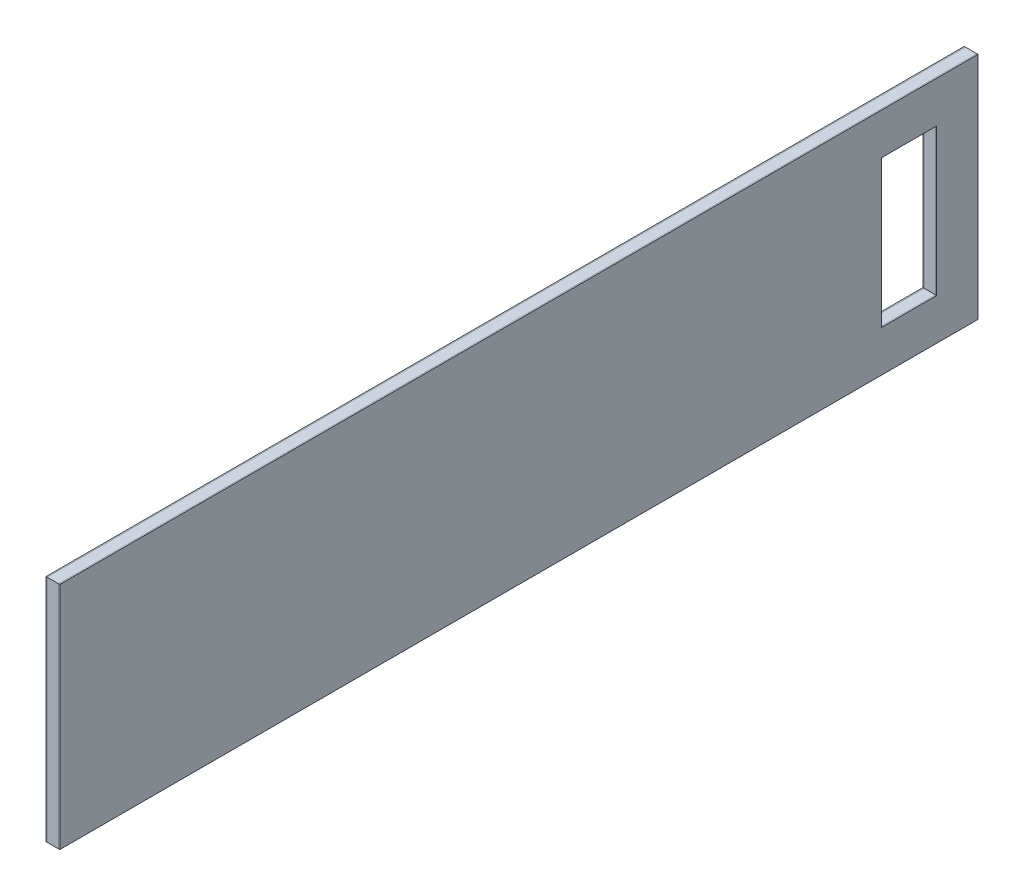
ISO-10303-21;
HEADER;
FILE_DESCRIPTION(('STEP AP214'),'2;1');
FILE_NAME('part.step','',(''),(''),'','','');
FILE_SCHEMA(('AUTOMOTIVE_DESIGN { 1 0 10303 214 1 1 1 1 }'));
ENDSEC;
DATA;
#1=APPLICATION_CONTEXT('core data for automotive mechanical design processes');
#2=APPLICATION_PROTOCOL_DEFINITION('international standard','automotive_design',2000,#1);
#3=PRODUCT_CONTEXT('',#1,'mechanical');
#4=PRODUCT('Part','Part','',(#3));
#5=PRODUCT_RELATED_PRODUCT_CATEGORY('part','',(#4));
#6=PRODUCT_DEFINITION_FORMATION('','',#4);
#7=PRODUCT_DEFINITION_CONTEXT('part definition',#1,'design');
#8=PRODUCT_DEFINITION('design','',#6,#7);
#9=PRODUCT_DEFINITION_SHAPE('','',#8);
#10=(LENGTH_UNIT() NAMED_UNIT(*) SI_UNIT(.MILLI.,.METRE.));
#11=(NAMED_UNIT(*) PLANE_ANGLE_UNIT() SI_UNIT($,.RADIAN.));
#12=(NAMED_UNIT(*) SI_UNIT($,.STERADIAN.) SOLID_ANGLE_UNIT());
#13=UNCERTAINTY_MEASURE_WITH_UNIT(LENGTH_MEASURE(1.E-05),#10,'distance_accuracy_value','');
#14=(GEOMETRIC_REPRESENTATION_CONTEXT(3) GLOBAL_UNCERTAINTY_ASSIGNED_CONTEXT((#13)) GLOBAL_UNIT_ASSIGNED_CONTEXT((#10,
#11,#12)) REPRESENTATION_CONTEXT('',''));
#15=CARTESIAN_POINT('',(0.,0.,0.));
#16=DIRECTION('',(0.,0.,1.));
#17=DIRECTION('',(1.,0.,0.));
#18=AXIS2_PLACEMENT_3D('',#15,#16,#17);
#19=CARTESIAN_POINT('',(-2.75,0.,-79.));
#20=DIRECTION('',(0.,0.,1.));
#21=DIRECTION('',(1.,0.,0.));
#22=AXIS2_PLACEMENT_3D('',#19,#20,#21);
#23=PLANE('',#22);
#24=DIRECTION('',(0.,-1.,0.));
#25=VECTOR('',#24,1.);
#26=CARTESIAN_POINT('',(-2.5,0.,-79.));
#27=LINE('',#26,#25);
#28=CARTESIAN_POINT('',(-2.5,16.,-79.));
#29=VERTEX_POINT('',#28);
#30=CARTESIAN_POINT('',(-2.5,-16.,-79.));
#31=VERTEX_POINT('',#30);
#32=EDGE_CURVE('E165',#29,#31,#27,.T.);
#33=ORIENTED_EDGE('',*,*,#32,.T.);
#34=DIRECTION('',(1.,0.,0.));
#35=VECTOR('',#34,1.);
#36=CARTESIAN_POINT('',(-2.75,-16.,-79.));
#37=LINE('',#36,#35);
#38=CARTESIAN_POINT('',(-2.75,-16.,-79.));
#39=VERTEX_POINT('',#38);
#40=EDGE_CURVE('E12',#39,#31,#37,.T.);
#41=ORIENTED_EDGE('',*,*,#40,.F.);
#42=DIRECTION('',(0.,-1.,0.));
#43=VECTOR('',#42,1.);
#44=CARTESIAN_POINT('',(-2.75,0.,-79.));
#45=LINE('',#44,#43);
#46=CARTESIAN_POINT('',(-2.75,16.,-79.));
#47=VERTEX_POINT('',#46);
#48=EDGE_CURVE('E142',#47,#39,#45,.T.);
#49=ORIENTED_EDGE('',*,*,#48,.F.);
#50=DIRECTION('',(1.,0.,0.));
#51=VECTOR('',#50,1.);
#52=CARTESIAN_POINT('',(-2.75,16.,-79.));
#53=LINE('',#52,#51);
#54=EDGE_CURVE('E172',#47,#29,#53,.T.);
#55=ORIENTED_EDGE('',*,*,#54,.T.);
#56=EDGE_LOOP('',(#33,#41,#49,#55));
#57=FACE_BOUND('',#56,.T.);
#58=ADVANCED_FACE('F60',(#57),#23,.F.);
#59=CARTESIAN_POINT('',(-2.75,-16.,0.));
#60=DIRECTION('',(0.,-1.,0.));
#61=DIRECTION('',(0.,0.,-1.));
#62=AXIS2_PLACEMENT_3D('',#59,#60,#61);
#63=PLANE('',#62);
#64=DIRECTION('',(0.,0.,-1.));
#65=VECTOR('',#64,1.);
#66=CARTESIAN_POINT('',(-2.5,-16.,0.));
#67=LINE('',#66,#65);
#68=CARTESIAN_POINT('',(-2.5,-16.,-91.));
#69=VERTEX_POINT('',#68);
#70=EDGE_CURVE('E147',#31,#69,#67,.T.);
#71=ORIENTED_EDGE('',*,*,#70,.T.);
#72=DIRECTION('',(1.,0.,0.));
#73=VECTOR('',#72,1.);
#74=CARTESIAN_POINT('',(-2.75,-16.,-91.));
#75=LINE('',#74,#73);
#76=CARTESIAN_POINT('',(-2.75,-16.,-91.));
#77=VERTEX_POINT('',#76);
#78=EDGE_CURVE('E70',#77,#69,#75,.T.);
#79=ORIENTED_EDGE('',*,*,#78,.F.);
#80=DIRECTION('',(0.,0.,-1.));
#81=VECTOR('',#80,1.);
#82=CARTESIAN_POINT('',(-2.75,-16.,0.));
#83=LINE('',#82,#81);
#84=EDGE_CURVE('E136',#39,#77,#83,.T.);
#85=ORIENTED_EDGE('',*,*,#84,.F.);
#86=ORIENTED_EDGE('',*,*,#40,.T.);
#87=EDGE_LOOP('',(#71,#79,#85,#86));
#88=FACE_BOUND('',#87,.T.);
#89=ADVANCED_FACE('F146',(#88),#63,.F.);
#90=CARTESIAN_POINT('',(-2.75,0.,-91.));
#91=DIRECTION('',(0.,0.,-1.));
#92=DIRECTION('',(-1.,0.,0.));
#93=AXIS2_PLACEMENT_3D('',#90,#91,#92);
#94=PLANE('',#93);
#95=DIRECTION('',(0.,1.,0.));
#96=VECTOR('',#95,1.);
#97=CARTESIAN_POINT('',(-2.5,0.,-91.));
#98=LINE('',#97,#96);
#99=CARTESIAN_POINT('',(-2.5,16.,-91.));
#100=VERTEX_POINT('',#99);
#101=EDGE_CURVE('E108',#69,#100,#98,.T.);
#102=ORIENTED_EDGE('',*,*,#101,.T.);
#103=DIRECTION('',(1.,0.,0.));
#104=VECTOR('',#103,1.);
#105=CARTESIAN_POINT('',(-2.75,16.,-91.));
#106=LINE('',#105,#104);
#107=CARTESIAN_POINT('',(-2.75,16.,-91.));
#108=VERTEX_POINT('',#107);
#109=EDGE_CURVE('E148',#108,#100,#106,.T.);
#110=ORIENTED_EDGE('',*,*,#109,.F.);
#111=DIRECTION('',(0.,1.,0.));
#112=VECTOR('',#111,1.);
#113=CARTESIAN_POINT('',(-2.75,0.,-91.));
#114=LINE('',#113,#112);
#115=EDGE_CURVE('E140',#77,#108,#114,.T.);
#116=ORIENTED_EDGE('',*,*,#115,.F.);
#117=ORIENTED_EDGE('',*,*,#78,.T.);
#118=EDGE_LOOP('',(#102,#110,#116,#117));
#119=FACE_BOUND('',#118,.T.);
#120=ADVANCED_FACE('F150',(#119),#94,.F.);
#121=CARTESIAN_POINT('',(-2.75,0.,100.));
#122=DIRECTION('',(0.,0.,-1.));
#123=DIRECTION('',(0.,1.,0.));
#124=AXIS2_PLACEMENT_3D('',#121,#122,#123);
#125=PLANE('',#124);
#126=DIRECTION('',(0.,1.,0.));
#127=VECTOR('',#126,1.);
#128=CARTESIAN_POINT('',(-2.5,0.,100.));
#129=LINE('',#128,#127);
#130=CARTESIAN_POINT('',(-2.5,-25.,100.));
#131=VERTEX_POINT('',#130);
#132=CARTESIAN_POINT('',(-2.5,25.,100.));
#133=VERTEX_POINT('',#132);
#134=EDGE_CURVE('E156',#131,#133,#129,.T.);
#135=ORIENTED_EDGE('',*,*,#134,.T.);
#136=DIRECTION('',(1.,0.,0.));
#137=VECTOR('',#136,1.);
#138=CARTESIAN_POINT('',(-2.75,25.,100.));
#139=LINE('',#138,#137);
#140=CARTESIAN_POINT('',(-2.75,25.,100.));
#141=VERTEX_POINT('',#140);
#142=EDGE_CURVE('E64',#141,#133,#139,.T.);
#143=ORIENTED_EDGE('',*,*,#142,.F.);
#144=DIRECTION('',(0.,1.,0.));
#145=VECTOR('',#144,1.);
#146=CARTESIAN_POINT('',(-2.75,0.,100.));
#147=LINE('',#146,#145);
#148=CARTESIAN_POINT('',(-2.75,-25.,100.));
#149=VERTEX_POINT('',#148);
#150=EDGE_CURVE('E171',#149,#141,#147,.T.);
#151=ORIENTED_EDGE('',*,*,#150,.F.);
#152=DIRECTION('',(1.,0.,0.));
#153=VECTOR('',#152,1.);
#154=CARTESIAN_POINT('',(-2.75,-25.,100.));
#155=LINE('',#154,#153);
#156=EDGE_CURVE('E152',#149,#131,#155,.T.);
#157=ORIENTED_EDGE('',*,*,#156,.T.);
#158=EDGE_LOOP('',(#135,#143,#151,#157));
#159=FACE_BOUND('',#158,.T.);
#160=ADVANCED_FACE('F62',(#159),#125,.F.);
#161=CARTESIAN_POINT('',(-2.75,25.,0.));
#162=DIRECTION('',(0.,-1.,0.));
#163=DIRECTION('',(0.,0.,-1.));
#164=AXIS2_PLACEMENT_3D('',#161,#162,#163);
#165=PLANE('',#164);
#166=DIRECTION('',(0.,0.,-1.));
#167=VECTOR('',#166,1.);
#168=CARTESIAN_POINT('',(-2.5,25.,0.));
#169=LINE('',#168,#167);
#170=CARTESIAN_POINT('',(-2.5,25.,-100.));
#171=VERTEX_POINT('',#170);
#172=EDGE_CURVE('E159',#133,#171,#169,.T.);
#173=ORIENTED_EDGE('',*,*,#172,.T.);
#174=DIRECTION('',(1.,0.,0.));
#175=VECTOR('',#174,1.);
#176=CARTESIAN_POINT('',(-2.75,25.,-100.));
#177=LINE('',#176,#175);
#178=CARTESIAN_POINT('',(-2.75,25.,-100.));
#179=VERTEX_POINT('',#178);
#180=EDGE_CURVE('E179',#179,#171,#177,.T.);
#181=ORIENTED_EDGE('',*,*,#180,.F.);
#182=DIRECTION('',(0.,0.,-1.));
#183=VECTOR('',#182,1.);
#184=CARTESIAN_POINT('',(-2.75,25.,0.));
#185=LINE('',#184,#183);
#186=EDGE_CURVE('E123',#141,#179,#185,.T.);
#187=ORIENTED_EDGE('',*,*,#186,.F.);
#188=ORIENTED_EDGE('',*,*,#142,.T.);
#189=EDGE_LOOP('',(#173,#181,#187,#188));
#190=FACE_BOUND('',#189,.T.);
#191=ADVANCED_FACE('F185',(#190),#165,.F.);
#192=CARTESIAN_POINT('',(-2.75,0.,-100.));
#193=DIRECTION('',(0.,0.,1.));
#194=DIRECTION('',(1.,0.,0.));
#195=AXIS2_PLACEMENT_3D('',#192,#193,#194);
#196=PLANE('',#195);
#197=DIRECTION('',(0.,-1.,0.));
#198=VECTOR('',#197,1.);
#199=CARTESIAN_POINT('',(-2.5,0.,-100.));
#200=LINE('',#199,#198);
#201=CARTESIAN_POINT('',(-2.5,-25.,-99.9999999999999));
#202=VERTEX_POINT('',#201);
#203=EDGE_CURVE('E161',#171,#202,#200,.T.);
#204=ORIENTED_EDGE('',*,*,#203,.T.);
#205=DIRECTION('',(1.,0.,0.));
#206=VECTOR('',#205,1.);
#207=CARTESIAN_POINT('',(-2.75,-25.,-99.9999999999999));
#208=LINE('',#207,#206);
#209=CARTESIAN_POINT('',(-2.75,-25.,-99.9999999999999));
#210=VERTEX_POINT('',#209);
#211=EDGE_CURVE('E177',#210,#202,#208,.T.);
#212=ORIENTED_EDGE('',*,*,#211,.F.);
#213=DIRECTION('',(0.,-1.,0.));
#214=VECTOR('',#213,1.);
#215=CARTESIAN_POINT('',(-2.75,0.,-100.));
#216=LINE('',#215,#214);
#217=EDGE_CURVE('E201',#179,#210,#216,.T.);
#218=ORIENTED_EDGE('',*,*,#217,.F.);
#219=ORIENTED_EDGE('',*,*,#180,.T.);
#220=EDGE_LOOP('',(#204,#212,#218,#219));
#221=FACE_BOUND('',#220,.T.);
#222=ADVANCED_FACE('F195',(#221),#196,.F.);
#223=CARTESIAN_POINT('',(-2.75,-25.,0.));
#224=DIRECTION('',(0.,1.,0.));
#225=DIRECTION('',(0.,0.,1.));
#226=AXIS2_PLACEMENT_3D('',#223,#224,#225);
#227=PLANE('',#226);
#228=DIRECTION('',(0.,0.,1.));
#229=VECTOR('',#228,1.);
#230=CARTESIAN_POINT('',(-2.5,-25.,0.));
#231=LINE('',#230,#229);
#232=EDGE_CURVE('E163',#202,#131,#231,.T.);
#233=ORIENTED_EDGE('',*,*,#232,.T.);
#234=ORIENTED_EDGE('',*,*,#156,.F.);
#235=DIRECTION('',(0.,0.,1.));
#236=VECTOR('',#235,1.);
#237=CARTESIAN_POINT('',(-2.75,-25.,0.));
#238=LINE('',#237,#236);
#239=EDGE_CURVE('E199',#210,#149,#238,.T.);
#240=ORIENTED_EDGE('',*,*,#239,.F.);
#241=ORIENTED_EDGE('',*,*,#211,.T.);
#242=EDGE_LOOP('',(#233,#234,#240,#241));
#243=FACE_BOUND('',#242,.T.);
#244=ADVANCED_FACE('F198',(#243),#227,.F.);
#245=CARTESIAN_POINT('',(-2.75,16.,0.));
#246=DIRECTION('',(0.,1.,0.));
#247=DIRECTION('',(0.,0.,1.));
#248=AXIS2_PLACEMENT_3D('',#245,#246,#247);
#249=PLANE('',#248);
#250=DIRECTION('',(0.,0.,1.));
#251=VECTOR('',#250,1.);
#252=CARTESIAN_POINT('',(-2.5,16.,0.));
#253=LINE('',#252,#251);
#254=EDGE_CURVE('E114',#100,#29,#253,.T.);
#255=ORIENTED_EDGE('',*,*,#254,.T.);
#256=ORIENTED_EDGE('',*,*,#54,.F.);
#257=DIRECTION('',(0.,0.,1.));
#258=VECTOR('',#257,1.);
#259=CARTESIAN_POINT('',(-2.75,16.,0.));
#260=LINE('',#259,#258);
#261=EDGE_CURVE('E79',#108,#47,#260,.T.);
#262=ORIENTED_EDGE('',*,*,#261,.F.);
#263=ORIENTED_EDGE('',*,*,#109,.T.);
#264=EDGE_LOOP('',(#255,#256,#262,#263));
#265=FACE_BOUND('',#264,.T.);
#266=ADVANCED_FACE('F207',(#265),#249,.F.);
#267=CARTESIAN_POINT('',(-2.75,0.,0.));
#268=DIRECTION('',(-1.,0.,0.));
#269=DIRECTION('',(0.,0.,1.));
#270=AXIS2_PLACEMENT_3D('',#267,#268,#269);
#271=PLANE('',#270);
#272=ORIENTED_EDGE('',*,*,#150,.T.);
#273=ORIENTED_EDGE('',*,*,#186,.T.);
#274=ORIENTED_EDGE('',*,*,#217,.T.);
#275=ORIENTED_EDGE('',*,*,#239,.T.);
#276=EDGE_LOOP('',(#272,#273,#274,#275));
#277=FACE_BOUND('',#276,.T.);
#278=ORIENTED_EDGE('',*,*,#48,.T.);
#279=ORIENTED_EDGE('',*,*,#84,.T.);
#280=ORIENTED_EDGE('',*,*,#115,.T.);
#281=ORIENTED_EDGE('',*,*,#261,.T.);
#282=EDGE_LOOP('',(#278,#279,#280,#281));
#283=FACE_BOUND('',#282,.T.);
#284=ADVANCED_FACE('F138',(#277,#283),#271,.T.);
#285=CARTESIAN_POINT('',(-2.5,0.,0.));
#286=DIRECTION('',(-1.,0.,0.));
#287=DIRECTION('',(0.,0.,1.));
#288=AXIS2_PLACEMENT_3D('',#285,#286,#287);
#289=PLANE('',#288);
#290=ORIENTED_EDGE('',*,*,#134,.F.);
#291=ORIENTED_EDGE('',*,*,#232,.F.);
#292=ORIENTED_EDGE('',*,*,#203,.F.);
#293=ORIENTED_EDGE('',*,*,#172,.F.);
#294=EDGE_LOOP('',(#290,#291,#292,#293));
#295=FACE_BOUND('',#294,.T.);
#296=ORIENTED_EDGE('',*,*,#32,.F.);
#297=ORIENTED_EDGE('',*,*,#254,.F.);
#298=ORIENTED_EDGE('',*,*,#101,.F.);
#299=ORIENTED_EDGE('',*,*,#70,.F.);
#300=EDGE_LOOP('',(#296,#297,#298,#299));
#301=FACE_BOUND('',#300,.T.);
#302=ADVANCED_FACE('F192',(#295,#301),#289,.F.);
#303=CLOSED_SHELL('',(#58,#89,#120,#160,#191,#222,#244,#266,#284,#302));
#304=MANIFOLD_SOLID_BREP('B2',#303);
#305=CARTESIAN_POINT('',(-2.5,25.,0.));
#306=DIRECTION('',(0.,-1.,0.));
#307=DIRECTION('',(0.,0.,-1.));
#308=AXIS2_PLACEMENT_3D('',#305,#306,#307);
#309=PLANE('',#308);
#310=DIRECTION('',(0.,0.,-1.));
#311=VECTOR('',#310,1.);
#312=CARTESIAN_POINT('',(0.,25.,0.));
#313=LINE('',#312,#311);
#314=CARTESIAN_POINT('',(0.,25.,100.));
#315=VERTEX_POINT('',#314);
#316=CARTESIAN_POINT('',(0.,25.,-99.9999999999999));
#317=VERTEX_POINT('',#316);
#318=EDGE_CURVE('E425',#315,#317,#313,.T.);
#319=ORIENTED_EDGE('',*,*,#318,.T.);
#320=DIRECTION('',(1.,0.,0.));
#321=VECTOR('',#320,1.);
#322=CARTESIAN_POINT('',(-2.5,25.,-99.9999999999999));
#323=LINE('',#322,#321);
#324=CARTESIAN_POINT('',(-2.5,25.,-99.9999999999999));
#325=VERTEX_POINT('',#324);
#326=EDGE_CURVE('E58',#325,#317,#323,.T.);
#327=ORIENTED_EDGE('',*,*,#326,.F.);
#328=DIRECTION('',(0.,0.,-1.));
#329=VECTOR('',#328,1.);
#330=CARTESIAN_POINT('',(-2.5,25.,0.));
#331=LINE('',#330,#329);
#332=CARTESIAN_POINT('',(-2.5,25.,100.));
#333=VERTEX_POINT('',#332);
#334=EDGE_CURVE('E394',#333,#325,#331,.T.);
#335=ORIENTED_EDGE('',*,*,#334,.F.);
#336=DIRECTION('',(1.,0.,0.));
#337=VECTOR('',#336,1.);
#338=CARTESIAN_POINT('',(-2.5,25.,100.));
#339=LINE('',#338,#337);
#340=EDGE_CURVE('E436',#333,#315,#339,.T.);
#341=ORIENTED_EDGE('',*,*,#340,.T.);
#342=EDGE_LOOP('',(#319,#327,#335,#341));
#343=FACE_BOUND('',#342,.T.);
#344=ADVANCED_FACE('F311',(#343),#309,.F.);
#345=CARTESIAN_POINT('',(-2.5,0.,-100.));
#346=DIRECTION('',(0.,0.,1.));
#347=DIRECTION('',(1.,0.,0.));
#348=AXIS2_PLACEMENT_3D('',#345,#346,#347);
#349=PLANE('',#348);
#350=DIRECTION('',(0.,-1.,0.));
#351=VECTOR('',#350,1.);
#352=CARTESIAN_POINT('',(0.,0.,-100.));
#353=LINE('',#352,#351);
#354=CARTESIAN_POINT('',(0.,-25.,-99.9999999999999));
#355=VERTEX_POINT('',#354);
#356=EDGE_CURVE('E400',#317,#355,#353,.T.);
#357=ORIENTED_EDGE('',*,*,#356,.T.);
#358=DIRECTION('',(1.,0.,0.));
#359=VECTOR('',#358,1.);
#360=CARTESIAN_POINT('',(-2.5,-25.,-99.9999999999999));
#361=LINE('',#360,#359);
#362=CARTESIAN_POINT('',(-2.5,-25.,-99.9999999999999));
#363=VERTEX_POINT('',#362);
#364=EDGE_CURVE('E322',#363,#355,#361,.T.);
#365=ORIENTED_EDGE('',*,*,#364,.F.);
#366=DIRECTION('',(0.,-1.,0.));
#367=VECTOR('',#366,1.);
#368=CARTESIAN_POINT('',(-2.5,0.,-100.));
#369=LINE('',#368,#367);
#370=EDGE_CURVE('E388',#325,#363,#369,.T.);
#371=ORIENTED_EDGE('',*,*,#370,.F.);
#372=ORIENTED_EDGE('',*,*,#326,.T.);
#373=EDGE_LOOP('',(#357,#365,#371,#372));
#374=FACE_BOUND('',#373,.T.);
#375=ADVANCED_FACE('F399',(#374),#349,.F.);
#376=CARTESIAN_POINT('',(-2.5,-25.,0.));
#377=DIRECTION('',(0.,1.,0.));
#378=DIRECTION('',(0.,0.,1.));
#379=AXIS2_PLACEMENT_3D('',#376,#377,#378);
#380=PLANE('',#379);
#381=DIRECTION('',(0.,0.,1.));
#382=VECTOR('',#381,1.);
#383=CARTESIAN_POINT('',(0.,-25.,0.));
#384=LINE('',#383,#382);
#385=CARTESIAN_POINT('',(0.,-25.,100.));
#386=VERTEX_POINT('',#385);
#387=EDGE_CURVE('E360',#355,#386,#384,.T.);
#388=ORIENTED_EDGE('',*,*,#387,.T.);
#389=DIRECTION('',(1.,0.,0.));
#390=VECTOR('',#389,1.);
#391=CARTESIAN_POINT('',(-2.5,-25.,100.));
#392=LINE('',#391,#390);
#393=CARTESIAN_POINT('',(-2.5,-25.,100.));
#394=VERTEX_POINT('',#393);
#395=EDGE_CURVE('E402',#394,#386,#392,.T.);
#396=ORIENTED_EDGE('',*,*,#395,.F.);
#397=DIRECTION('',(0.,0.,1.));
#398=VECTOR('',#397,1.);
#399=CARTESIAN_POINT('',(-2.5,-25.,0.));
#400=LINE('',#399,#398);
#401=EDGE_CURVE('E392',#363,#394,#400,.T.);
#402=ORIENTED_EDGE('',*,*,#401,.F.);
#403=ORIENTED_EDGE('',*,*,#364,.T.);
#404=EDGE_LOOP('',(#388,#396,#402,#403));
#405=FACE_BOUND('',#404,.T.);
#406=ADVANCED_FACE('F404',(#405),#380,.F.);
#407=CARTESIAN_POINT('',(-2.5,-16.,0.));
#408=DIRECTION('',(0.,-1.,0.));
#409=DIRECTION('',(0.,0.,-1.));
#410=AXIS2_PLACEMENT_3D('',#407,#408,#409);
#411=PLANE('',#410);
#412=DIRECTION('',(0.,0.,-1.));
#413=VECTOR('',#412,1.);
#414=CARTESIAN_POINT('',(0.,-16.,0.));
#415=LINE('',#414,#413);
#416=CARTESIAN_POINT('',(0.,-16.,-79.));
#417=VERTEX_POINT('',#416);
#418=CARTESIAN_POINT('',(0.,-16.,-91.));
#419=VERTEX_POINT('',#418);
#420=EDGE_CURVE('E412',#417,#419,#415,.T.);
#421=ORIENTED_EDGE('',*,*,#420,.T.);
#422=DIRECTION('',(1.,0.,0.));
#423=VECTOR('',#422,1.);
#424=CARTESIAN_POINT('',(-2.5,-16.,-91.));
#425=LINE('',#424,#423);
#426=CARTESIAN_POINT('',(-2.5,-16.,-91.));
#427=VERTEX_POINT('',#426);
#428=EDGE_CURVE('E315',#427,#419,#425,.T.);
#429=ORIENTED_EDGE('',*,*,#428,.F.);
#430=DIRECTION('',(0.,0.,-1.));
#431=VECTOR('',#430,1.);
#432=CARTESIAN_POINT('',(-2.5,-16.,0.));
#433=LINE('',#432,#431);
#434=CARTESIAN_POINT('',(-2.5,-16.,-79.));
#435=VERTEX_POINT('',#434);
#436=EDGE_CURVE('E435',#435,#427,#433,.T.);
#437=ORIENTED_EDGE('',*,*,#436,.F.);
#438=DIRECTION('',(1.,0.,0.));
#439=VECTOR('',#438,1.);
#440=CARTESIAN_POINT('',(-2.5,-16.,-79.));
#441=LINE('',#440,#439);
#442=EDGE_CURVE('E408',#435,#417,#441,.T.);
#443=ORIENTED_EDGE('',*,*,#442,.T.);
#444=EDGE_LOOP('',(#421,#429,#437,#443));
#445=FACE_BOUND('',#444,.T.);
#446=ADVANCED_FACE('F313',(#445),#411,.F.);
#447=CARTESIAN_POINT('',(-2.5,0.,-91.));
#448=DIRECTION('',(0.,0.,-1.));
#449=DIRECTION('',(-1.,0.,0.));
#450=AXIS2_PLACEMENT_3D('',#447,#448,#449);
#451=PLANE('',#450);
#452=DIRECTION('',(0.,1.,0.));
#453=VECTOR('',#452,1.);
#454=CARTESIAN_POINT('',(0.,0.,-91.));
#455=LINE('',#454,#453);
#456=CARTESIAN_POINT('',(0.,16.,-91.));
#457=VERTEX_POINT('',#456);
#458=EDGE_CURVE('E416',#419,#457,#455,.T.);
#459=ORIENTED_EDGE('',*,*,#458,.T.);
#460=DIRECTION('',(1.,0.,0.));
#461=VECTOR('',#460,1.);
#462=CARTESIAN_POINT('',(-2.5,16.,-91.));
#463=LINE('',#462,#461);
#464=CARTESIAN_POINT('',(-2.5,16.,-91.));
#465=VERTEX_POINT('',#464);
#466=EDGE_CURVE('E447',#465,#457,#463,.T.);
#467=ORIENTED_EDGE('',*,*,#466,.F.);
#468=DIRECTION('',(0.,1.,0.));
#469=VECTOR('',#468,1.);
#470=CARTESIAN_POINT('',(-2.5,0.,-91.));
#471=LINE('',#470,#469);
#472=EDGE_CURVE('E375',#427,#465,#471,.T.);
#473=ORIENTED_EDGE('',*,*,#472,.F.);
#474=ORIENTED_EDGE('',*,*,#428,.T.);
#475=EDGE_LOOP('',(#459,#467,#473,#474));
#476=FACE_BOUND('',#475,.T.);
#477=ADVANCED_FACE('F455',(#476),#451,.F.);
#478=CARTESIAN_POINT('',(-2.5,16.,0.));
#479=DIRECTION('',(0.,1.,0.));
#480=DIRECTION('',(0.,0.,1.));
#481=AXIS2_PLACEMENT_3D('',#478,#479,#480);
#482=PLANE('',#481);
#483=DIRECTION('',(0.,0.,1.));
#484=VECTOR('',#483,1.);
#485=CARTESIAN_POINT('',(0.,16.,0.));
#486=LINE('',#485,#484);
#487=CARTESIAN_POINT('',(0.,16.,-79.));
#488=VERTEX_POINT('',#487);
#489=EDGE_CURVE('E419',#457,#488,#486,.T.);
#490=ORIENTED_EDGE('',*,*,#489,.T.);
#491=DIRECTION('',(1.,0.,0.));
#492=VECTOR('',#491,1.);
#493=CARTESIAN_POINT('',(-2.5,16.,-79.));
#494=LINE('',#493,#492);
#495=CARTESIAN_POINT('',(-2.5,16.,-79.));
#496=VERTEX_POINT('',#495);
#497=EDGE_CURVE('E444',#496,#488,#494,.T.);
#498=ORIENTED_EDGE('',*,*,#497,.F.);
#499=DIRECTION('',(0.,0.,1.));
#500=VECTOR('',#499,1.);
#501=CARTESIAN_POINT('',(-2.5,16.,0.));
#502=LINE('',#501,#500);
#503=EDGE_CURVE('E472',#465,#496,#502,.T.);
#504=ORIENTED_EDGE('',*,*,#503,.F.);
#505=ORIENTED_EDGE('',*,*,#466,.T.);
#506=EDGE_LOOP('',(#490,#498,#504,#505));
#507=FACE_BOUND('',#506,.T.);
#508=ADVANCED_FACE('F465',(#507),#482,.F.);
#509=CARTESIAN_POINT('',(-2.5,0.,-79.));
#510=DIRECTION('',(0.,0.,1.));
#511=DIRECTION('',(1.,0.,0.));
#512=AXIS2_PLACEMENT_3D('',#509,#510,#511);
#513=PLANE('',#512);
#514=DIRECTION('',(0.,-1.,0.));
#515=VECTOR('',#514,1.);
#516=CARTESIAN_POINT('',(0.,0.,-79.));
#517=LINE('',#516,#515);
#518=EDGE_CURVE('E422',#488,#417,#517,.T.);
#519=ORIENTED_EDGE('',*,*,#518,.T.);
#520=ORIENTED_EDGE('',*,*,#442,.F.);
#521=DIRECTION('',(0.,-1.,0.));
#522=VECTOR('',#521,1.);
#523=CARTESIAN_POINT('',(-2.5,0.,-79.));
#524=LINE('',#523,#522);
#525=EDGE_CURVE('E469',#496,#435,#524,.T.);
#526=ORIENTED_EDGE('',*,*,#525,.F.);
#527=ORIENTED_EDGE('',*,*,#497,.T.);
#528=EDGE_LOOP('',(#519,#520,#526,#527));
#529=FACE_BOUND('',#528,.T.);
#530=ADVANCED_FACE('F468',(#529),#513,.F.);
#531=CARTESIAN_POINT('',(-2.5,0.,100.));
#532=DIRECTION('',(0.,0.,-1.));
#533=DIRECTION('',(0.,1.,0.));
#534=AXIS2_PLACEMENT_3D('',#531,#532,#533);
#535=PLANE('',#534);
#536=DIRECTION('',(0.,1.,0.));
#537=VECTOR('',#536,1.);
#538=CARTESIAN_POINT('',(0.,0.,100.));
#539=LINE('',#538,#537);
#540=EDGE_CURVE('E366',#386,#315,#539,.T.);
#541=ORIENTED_EDGE('',*,*,#540,.T.);
#542=ORIENTED_EDGE('',*,*,#340,.F.);
#543=DIRECTION('',(0.,1.,0.));
#544=VECTOR('',#543,1.);
#545=CARTESIAN_POINT('',(-2.5,0.,100.));
#546=LINE('',#545,#544);
#547=EDGE_CURVE('E331',#394,#333,#546,.T.);
#548=ORIENTED_EDGE('',*,*,#547,.F.);
#549=ORIENTED_EDGE('',*,*,#395,.T.);
#550=EDGE_LOOP('',(#541,#542,#548,#549));
#551=FACE_BOUND('',#550,.T.);
#552=ADVANCED_FACE('F482',(#551),#535,.F.);
#553=CARTESIAN_POINT('',(-2.5,0.,0.));
#554=DIRECTION('',(-1.,0.,0.));
#555=DIRECTION('',(0.,0.,1.));
#556=AXIS2_PLACEMENT_3D('',#553,#554,#555);
#557=PLANE('',#556);
#558=ORIENTED_EDGE('',*,*,#436,.T.);
#559=ORIENTED_EDGE('',*,*,#472,.T.);
#560=ORIENTED_EDGE('',*,*,#503,.T.);
#561=ORIENTED_EDGE('',*,*,#525,.T.);
#562=EDGE_LOOP('',(#558,#559,#560,#561));
#563=FACE_BOUND('',#562,.T.);
#564=ORIENTED_EDGE('',*,*,#334,.T.);
#565=ORIENTED_EDGE('',*,*,#370,.T.);
#566=ORIENTED_EDGE('',*,*,#401,.T.);
#567=ORIENTED_EDGE('',*,*,#547,.T.);
#568=EDGE_LOOP('',(#564,#565,#566,#567));
#569=FACE_BOUND('',#568,.T.);
#570=ADVANCED_FACE('F390',(#563,#569),#557,.T.);
#571=CARTESIAN_POINT('',(0.,0.,0.));
#572=DIRECTION('',(-1.,0.,0.));
#573=DIRECTION('',(0.,0.,1.));
#574=AXIS2_PLACEMENT_3D('',#571,#572,#573);
#575=PLANE('',#574);
#576=ORIENTED_EDGE('',*,*,#420,.F.);
#577=ORIENTED_EDGE('',*,*,#518,.F.);
#578=ORIENTED_EDGE('',*,*,#489,.F.);
#579=ORIENTED_EDGE('',*,*,#458,.F.);
#580=EDGE_LOOP('',(#576,#577,#578,#579));
#581=FACE_BOUND('',#580,.T.);
#582=ORIENTED_EDGE('',*,*,#318,.F.);
#583=ORIENTED_EDGE('',*,*,#540,.F.);
#584=ORIENTED_EDGE('',*,*,#387,.F.);
#585=ORIENTED_EDGE('',*,*,#356,.F.);
#586=EDGE_LOOP('',(#582,#583,#584,#585));
#587=FACE_BOUND('',#586,.T.);
#588=ADVANCED_FACE('F462',(#581,#587),#575,.F.);
#589=CLOSED_SHELL('',(#344,#375,#406,#446,#477,#508,#530,#552,#570,#588));
#590=MANIFOLD_SOLID_BREP('B6',#589);
#591=CARTESIAN_POINT('',(0.25,0.,0.));
#592=DIRECTION('',(1.,0.,0.));
#593=DIRECTION('',(0.,0.,-1.));
#594=AXIS2_PLACEMENT_3D('',#591,#592,#593);
#595=PLANE('',#594);
#596=DIRECTION('',(0.,1.,0.));
#597=VECTOR('',#596,1.);
#598=CARTESIAN_POINT('',(0.25,25.,-100.));
#599=LINE('',#598,#597);
#600=CARTESIAN_POINT('',(0.25,-25.,-100.));
#601=VERTEX_POINT('',#600);
#602=CARTESIAN_POINT('',(0.25,25.,-100.));
#603=VERTEX_POINT('',#602);
#604=EDGE_CURVE('E678',#601,#603,#599,.T.);
#605=ORIENTED_EDGE('',*,*,#604,.T.);
#606=DIRECTION('',(0.,0.,1.));
#607=VECTOR('',#606,1.);
#608=CARTESIAN_POINT('',(0.25,25.,100.));
#609=LINE('',#608,#607);
#610=CARTESIAN_POINT('',(0.25,25.,100.));
#611=VERTEX_POINT('',#610);
#612=EDGE_CURVE('E681',#603,#611,#609,.T.);
#613=ORIENTED_EDGE('',*,*,#612,.T.);
#614=DIRECTION('',(0.,-1.,0.));
#615=VECTOR('',#614,1.);
#616=CARTESIAN_POINT('',(0.25,25.,100.));
#617=LINE('',#616,#615);
#618=CARTESIAN_POINT('',(0.25,-25.,100.));
#619=VERTEX_POINT('',#618);
#620=EDGE_CURVE('E684',#611,#619,#617,.T.);
#621=ORIENTED_EDGE('',*,*,#620,.T.);
#622=DIRECTION('',(0.,0.,-1.));
#623=VECTOR('',#622,1.);
#624=CARTESIAN_POINT('',(0.25,-25.,100.));
#625=LINE('',#624,#623);
#626=EDGE_CURVE('E686',#619,#601,#625,.T.);
#627=ORIENTED_EDGE('',*,*,#626,.T.);
#628=EDGE_LOOP('',(#605,#613,#621,#627));
#629=FACE_BOUND('',#628,.T.);
#630=DIRECTION('',(0.,0.,1.));
#631=VECTOR('',#630,1.);
#632=CARTESIAN_POINT('',(0.25,16.,-79.));
#633=LINE('',#632,#631);
#634=CARTESIAN_POINT('',(0.25,16.,-91.));
#635=VERTEX_POINT('',#634);
#636=CARTESIAN_POINT('',(0.25,16.,-79.));
#637=VERTEX_POINT('',#636);
#638=EDGE_CURVE('E650',#635,#637,#633,.T.);
#639=ORIENTED_EDGE('',*,*,#638,.F.);
#640=DIRECTION('',(0.,1.,0.));
#641=VECTOR('',#640,1.);
#642=CARTESIAN_POINT('',(0.25,16.,-91.));
#643=LINE('',#642,#641);
#644=CARTESIAN_POINT('',(0.25,-16.,-91.));
#645=VERTEX_POINT('',#644);
#646=EDGE_CURVE('E642',#645,#635,#643,.T.);
#647=ORIENTED_EDGE('',*,*,#646,.F.);
#648=DIRECTION('',(0.,0.,-1.));
#649=VECTOR('',#648,1.);
#650=CARTESIAN_POINT('',(0.25,-16.,-79.));
#651=LINE('',#650,#649);
#652=CARTESIAN_POINT('',(0.25,-16.,-79.));
#653=VERTEX_POINT('',#652);
#654=EDGE_CURVE('E664',#653,#645,#651,.T.);
#655=ORIENTED_EDGE('',*,*,#654,.F.);
#656=DIRECTION('',(0.,-1.,0.));
#657=VECTOR('',#656,1.);
#658=CARTESIAN_POINT('',(0.25,16.,-79.));
#659=LINE('',#658,#657);
#660=EDGE_CURVE('E662',#637,#653,#659,.T.);
#661=ORIENTED_EDGE('',*,*,#660,.F.);
#662=EDGE_LOOP('',(#639,#647,#655,#661));
#663=FACE_BOUND('',#662,.T.);
#664=ADVANCED_FACE('F577',(#629,#663),#595,.T.);
#665=CARTESIAN_POINT('',(0.,0.,0.));
#666=DIRECTION('',(1.,0.,0.));
#667=DIRECTION('',(0.,0.,-1.));
#668=AXIS2_PLACEMENT_3D('',#665,#666,#667);
#669=PLANE('',#668);
#670=DIRECTION('',(0.,1.,0.));
#671=VECTOR('',#670,1.);
#672=CARTESIAN_POINT('',(0.,25.,-100.));
#673=LINE('',#672,#671);
#674=CARTESIAN_POINT('',(0.,-25.,-100.));
#675=VERTEX_POINT('',#674);
#676=CARTESIAN_POINT('',(0.,25.,-100.));
#677=VERTEX_POINT('',#676);
#678=EDGE_CURVE('E658',#675,#677,#673,.T.);
#679=ORIENTED_EDGE('',*,*,#678,.F.);
#680=DIRECTION('',(0.,0.,-1.));
#681=VECTOR('',#680,1.);
#682=CARTESIAN_POINT('',(0.,-25.,100.));
#683=LINE('',#682,#681);
#684=CARTESIAN_POINT('',(0.,-25.,100.));
#685=VERTEX_POINT('',#684);
#686=EDGE_CURVE('E682',#685,#675,#683,.T.);
#687=ORIENTED_EDGE('',*,*,#686,.F.);
#688=DIRECTION('',(0.,-1.,0.));
#689=VECTOR('',#688,1.);
#690=CARTESIAN_POINT('',(0.,25.,100.));
#691=LINE('',#690,#689);
#692=CARTESIAN_POINT('',(0.,25.,100.));
#693=VERTEX_POINT('',#692);
#694=EDGE_CURVE('E693',#693,#685,#691,.T.);
#695=ORIENTED_EDGE('',*,*,#694,.F.);
#696=DIRECTION('',(0.,0.,1.));
#697=VECTOR('',#696,1.);
#698=CARTESIAN_POINT('',(0.,25.,100.));
#699=LINE('',#698,#697);
#700=EDGE_CURVE('E691',#677,#693,#699,.T.);
#701=ORIENTED_EDGE('',*,*,#700,.F.);
#702=EDGE_LOOP('',(#679,#687,#695,#701));
#703=FACE_BOUND('',#702,.T.);
#704=DIRECTION('',(0.,1.,0.));
#705=VECTOR('',#704,1.);
#706=CARTESIAN_POINT('',(0.,16.,-91.));
#707=LINE('',#706,#705);
#708=CARTESIAN_POINT('',(0.,-16.,-91.));
#709=VERTEX_POINT('',#708);
#710=CARTESIAN_POINT('',(0.,16.,-91.));
#711=VERTEX_POINT('',#710);
#712=EDGE_CURVE('E600',#709,#711,#707,.T.);
#713=ORIENTED_EDGE('',*,*,#712,.T.);
#714=DIRECTION('',(0.,0.,1.));
#715=VECTOR('',#714,1.);
#716=CARTESIAN_POINT('',(0.,16.,-79.));
#717=LINE('',#716,#715);
#718=CARTESIAN_POINT('',(0.,16.,-79.));
#719=VERTEX_POINT('',#718);
#720=EDGE_CURVE('E657',#711,#719,#717,.T.);
#721=ORIENTED_EDGE('',*,*,#720,.T.);
#722=DIRECTION('',(0.,-1.,0.));
#723=VECTOR('',#722,1.);
#724=CARTESIAN_POINT('',(0.,16.,-79.));
#725=LINE('',#724,#723);
#726=CARTESIAN_POINT('',(0.,-16.,-79.));
#727=VERTEX_POINT('',#726);
#728=EDGE_CURVE('E670',#719,#727,#725,.T.);
#729=ORIENTED_EDGE('',*,*,#728,.T.);
#730=DIRECTION('',(0.,0.,-1.));
#731=VECTOR('',#730,1.);
#732=CARTESIAN_POINT('',(0.,-16.,-79.));
#733=LINE('',#732,#731);
#734=EDGE_CURVE('E651',#727,#709,#733,.T.);
#735=ORIENTED_EDGE('',*,*,#734,.T.);
#736=EDGE_LOOP('',(#713,#721,#729,#735));
#737=FACE_BOUND('',#736,.T.);
#738=ADVANCED_FACE('F711',(#703,#737),#669,.F.);
#739=CARTESIAN_POINT('',(0.25,25.,-100.));
#740=DIRECTION('',(0.,0.,1.));
#741=DIRECTION('',(1.,0.,0.));
#742=AXIS2_PLACEMENT_3D('',#739,#740,#741);
#743=PLANE('',#742);
#744=ORIENTED_EDGE('',*,*,#678,.T.);
#745=DIRECTION('',(-1.,0.,0.));
#746=VECTOR('',#745,1.);
#747=CARTESIAN_POINT('',(0.25,25.,-100.));
#748=LINE('',#747,#746);
#749=EDGE_CURVE('E309',#603,#677,#748,.T.);
#750=ORIENTED_EDGE('',*,*,#749,.F.);
#751=ORIENTED_EDGE('',*,*,#604,.F.);
#752=DIRECTION('',(-1.,0.,0.));
#753=VECTOR('',#752,1.);
#754=CARTESIAN_POINT('',(0.25,-25.,-100.));
#755=LINE('',#754,#753);
#756=EDGE_CURVE('E688',#601,#675,#755,.T.);
#757=ORIENTED_EDGE('',*,*,#756,.T.);
#758=EDGE_LOOP('',(#744,#750,#751,#757));
#759=FACE_BOUND('',#758,.T.);
#760=ADVANCED_FACE('F579',(#759),#743,.F.);
#761=CARTESIAN_POINT('',(0.25,25.,100.));
#762=DIRECTION('',(0.,-1.,0.));
#763=DIRECTION('',(0.,0.,-1.));
#764=AXIS2_PLACEMENT_3D('',#761,#762,#763);
#765=PLANE('',#764);
#766=ORIENTED_EDGE('',*,*,#700,.T.);
#767=DIRECTION('',(-1.,0.,0.));
#768=VECTOR('',#767,1.);
#769=CARTESIAN_POINT('',(0.25,25.,100.));
#770=LINE('',#769,#768);
#771=EDGE_CURVE('E585',#611,#693,#770,.T.);
#772=ORIENTED_EDGE('',*,*,#771,.F.);
#773=ORIENTED_EDGE('',*,*,#612,.F.);
#774=ORIENTED_EDGE('',*,*,#749,.T.);
#775=EDGE_LOOP('',(#766,#772,#773,#774));
#776=FACE_BOUND('',#775,.T.);
#777=ADVANCED_FACE('F721',(#776),#765,.F.);
#778=CARTESIAN_POINT('',(0.25,25.,100.));
#779=DIRECTION('',(0.,0.,-1.));
#780=DIRECTION('',(0.,1.,0.));
#781=AXIS2_PLACEMENT_3D('',#778,#779,#780);
#782=PLANE('',#781);
#783=ORIENTED_EDGE('',*,*,#694,.T.);
#784=DIRECTION('',(-1.,0.,0.));
#785=VECTOR('',#784,1.);
#786=CARTESIAN_POINT('',(0.25,-25.,100.));
#787=LINE('',#786,#785);
#788=EDGE_CURVE('E698',#619,#685,#787,.T.);
#789=ORIENTED_EDGE('',*,*,#788,.F.);
#790=ORIENTED_EDGE('',*,*,#620,.F.);
#791=ORIENTED_EDGE('',*,*,#771,.T.);
#792=EDGE_LOOP('',(#783,#789,#790,#791));
#793=FACE_BOUND('',#792,.T.);
#794=ADVANCED_FACE('F705',(#793),#782,.F.);
#795=CARTESIAN_POINT('',(0.25,-25.,100.));
#796=DIRECTION('',(0.,1.,0.));
#797=DIRECTION('',(0.,0.,1.));
#798=AXIS2_PLACEMENT_3D('',#795,#796,#797);
#799=PLANE('',#798);
#800=ORIENTED_EDGE('',*,*,#686,.T.);
#801=ORIENTED_EDGE('',*,*,#756,.F.);
#802=ORIENTED_EDGE('',*,*,#626,.F.);
#803=ORIENTED_EDGE('',*,*,#788,.T.);
#804=EDGE_LOOP('',(#800,#801,#802,#803));
#805=FACE_BOUND('',#804,.T.);
#806=ADVANCED_FACE('F715',(#805),#799,.F.);
#807=CARTESIAN_POINT('',(0.25,16.,-91.));
#808=DIRECTION('',(0.,0.,1.));
#809=DIRECTION('',(1.,0.,0.));
#810=AXIS2_PLACEMENT_3D('',#807,#808,#809);
#811=PLANE('',#810);
#812=ORIENTED_EDGE('',*,*,#712,.F.);
#813=DIRECTION('',(-1.,0.,0.));
#814=VECTOR('',#813,1.);
#815=CARTESIAN_POINT('',(0.25,-16.,-91.));
#816=LINE('',#815,#814);
#817=EDGE_CURVE('E646',#645,#709,#816,.T.);
#818=ORIENTED_EDGE('',*,*,#817,.F.);
#819=ORIENTED_EDGE('',*,*,#646,.T.);
#820=DIRECTION('',(-1.,0.,0.));
#821=VECTOR('',#820,1.);
#822=CARTESIAN_POINT('',(0.25,16.,-91.));
#823=LINE('',#822,#821);
#824=EDGE_CURVE('E645',#635,#711,#823,.T.);
#825=ORIENTED_EDGE('',*,*,#824,.T.);
#826=EDGE_LOOP('',(#812,#818,#819,#825));
#827=FACE_BOUND('',#826,.T.);
#828=ADVANCED_FACE('F644',(#827),#811,.T.);
#829=CARTESIAN_POINT('',(0.25,16.,-79.));
#830=DIRECTION('',(0.,-1.,0.));
#831=DIRECTION('',(0.,0.,-1.));
#832=AXIS2_PLACEMENT_3D('',#829,#830,#831);
#833=PLANE('',#832);
#834=ORIENTED_EDGE('',*,*,#720,.F.);
#835=ORIENTED_EDGE('',*,*,#824,.F.);
#836=ORIENTED_EDGE('',*,*,#638,.T.);
#837=DIRECTION('',(-1.,0.,0.));
#838=VECTOR('',#837,1.);
#839=CARTESIAN_POINT('',(0.25,16.,-79.));
#840=LINE('',#839,#838);
#841=EDGE_CURVE('E659',#637,#719,#840,.T.);
#842=ORIENTED_EDGE('',*,*,#841,.T.);
#843=EDGE_LOOP('',(#834,#835,#836,#842));
#844=FACE_BOUND('',#843,.T.);
#845=ADVANCED_FACE('F654',(#844),#833,.T.);
#846=CARTESIAN_POINT('',(0.25,16.,-79.));
#847=DIRECTION('',(0.,0.,-1.));
#848=DIRECTION('',(-1.,0.,0.));
#849=AXIS2_PLACEMENT_3D('',#846,#847,#848);
#850=PLANE('',#849);
#851=ORIENTED_EDGE('',*,*,#728,.F.);
#852=ORIENTED_EDGE('',*,*,#841,.F.);
#853=ORIENTED_EDGE('',*,*,#660,.T.);
#854=DIRECTION('',(-1.,0.,0.));
#855=VECTOR('',#854,1.);
#856=CARTESIAN_POINT('',(0.25,-16.,-79.));
#857=LINE('',#856,#855);
#858=EDGE_CURVE('E592',#653,#727,#857,.T.);
#859=ORIENTED_EDGE('',*,*,#858,.T.);
#860=EDGE_LOOP('',(#851,#852,#853,#859));
#861=FACE_BOUND('',#860,.T.);
#862=ADVANCED_FACE('F744',(#861),#850,.T.);
#863=CARTESIAN_POINT('',(0.25,-16.,-79.));
#864=DIRECTION('',(0.,1.,0.));
#865=DIRECTION('',(0.,0.,1.));
#866=AXIS2_PLACEMENT_3D('',#863,#864,#865);
#867=PLANE('',#866);
#868=ORIENTED_EDGE('',*,*,#734,.F.);
#869=ORIENTED_EDGE('',*,*,#858,.F.);
#870=ORIENTED_EDGE('',*,*,#654,.T.);
#871=ORIENTED_EDGE('',*,*,#817,.T.);
#872=EDGE_LOOP('',(#868,#869,#870,#871));
#873=FACE_BOUND('',#872,.T.);
#874=ADVANCED_FACE('F748',(#873),#867,.T.);
#875=CLOSED_SHELL('',(#664,#738,#760,#777,#794,#806,#828,#845,#862,#874));
#876=MANIFOLD_SOLID_BREP('B52',#875);
#877=ADVANCED_BREP_SHAPE_REPRESENTATION('',(#18,#304,#590,#876),#14);
#878=SHAPE_DEFINITION_REPRESENTATION(#9,#877);
ENDSEC;
END-ISO-10303-21;
